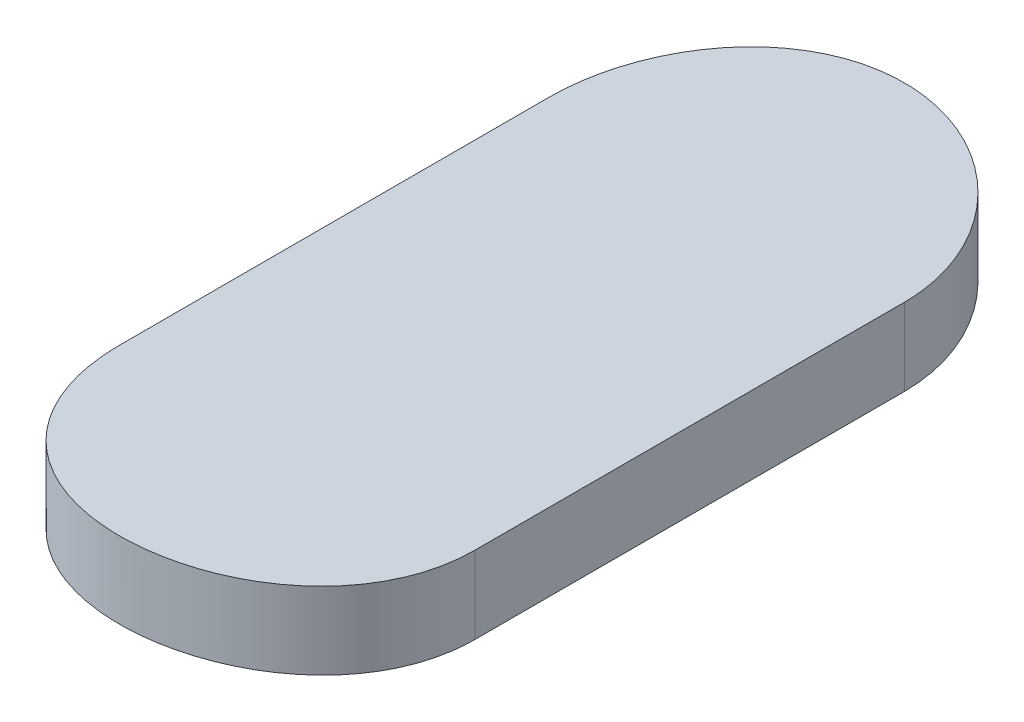
ISO-10303-21;
HEADER;
FILE_DESCRIPTION(('STEP AP214'),'2;1');
FILE_NAME('part.step','',(''),(''),'','','');
FILE_SCHEMA(('AUTOMOTIVE_DESIGN { 1 0 10303 214 1 1 1 1 }'));
ENDSEC;
DATA;
#1=APPLICATION_CONTEXT('core data for automotive mechanical design processes');
#2=APPLICATION_PROTOCOL_DEFINITION('international standard','automotive_design',2000,#1);
#3=PRODUCT_CONTEXT('',#1,'mechanical');
#4=PRODUCT('Part','Part','',(#3));
#5=PRODUCT_RELATED_PRODUCT_CATEGORY('part','',(#4));
#6=PRODUCT_DEFINITION_FORMATION('','',#4);
#7=PRODUCT_DEFINITION_CONTEXT('part definition',#1,'design');
#8=PRODUCT_DEFINITION('design','',#6,#7);
#9=PRODUCT_DEFINITION_SHAPE('','',#8);
#10=(LENGTH_UNIT() NAMED_UNIT(*) SI_UNIT(.MILLI.,.METRE.));
#11=(NAMED_UNIT(*) PLANE_ANGLE_UNIT() SI_UNIT($,.RADIAN.));
#12=(NAMED_UNIT(*) SI_UNIT($,.STERADIAN.) SOLID_ANGLE_UNIT());
#13=UNCERTAINTY_MEASURE_WITH_UNIT(LENGTH_MEASURE(1.E-05),#10,'distance_accuracy_value','');
#14=(GEOMETRIC_REPRESENTATION_CONTEXT(3) GLOBAL_UNCERTAINTY_ASSIGNED_CONTEXT((#13)) GLOBAL_UNIT_ASSIGNED_CONTEXT((#10,
#11,#12)) REPRESENTATION_CONTEXT('',''));
#15=CARTESIAN_POINT('',(0.,0.,0.));
#16=DIRECTION('',(0.,0.,1.));
#17=DIRECTION('',(1.,0.,0.));
#18=AXIS2_PLACEMENT_3D('',#15,#16,#17);
#19=CARTESIAN_POINT('',(-75.4181941684126,-39.6644186635389,0.584683614855501));
#20=DIRECTION('',(0.,0.,1.));
#21=DIRECTION('',(1.,0.,0.));
#22=AXIS2_PLACEMENT_3D('',#19,#20,#21);
#23=CYLINDRICAL_SURFACE('',#22,2.00000000000003);
#24=DIRECTION('',(0.,0.,1.));
#25=VECTOR('',#24,1.);
#26=CARTESIAN_POINT('',(-75.6966157953255,-37.6838931278117,-0.202724824976189));
#27=LINE('',#26,#25);
#28=CARTESIAN_POINT('',(-75.6966157953255,-37.6838931278117,-0.876239996943084));
#29=VERTEX_POINT('',#28);
#30=CARTESIAN_POINT('',(-75.6966157953255,-37.6838931278117,-0.202724824976189));
#31=VERTEX_POINT('',#30);
#32=EDGE_CURVE('E72',#29,#31,#27,.T.);
#33=ORIENTED_EDGE('',*,*,#32,.T.);
#34=CARTESIAN_POINT('',(-75.1397725414866,-37.6838931278136,-0.202724824976189));
#35=CARTESIAN_POINT('',(-75.1397588796207,-37.6839002866824,-0.187141875815704));
#36=CARTESIAN_POINT('',(-75.1410799225853,-37.6837094111274,-0.171564623124754));
#37=CARTESIAN_POINT('',(-75.1462885944889,-37.6829849067766,-0.140870770455341));
#38=CARTESIAN_POINT('',(-75.1501733182881,-37.6824516659645,-0.12575366929832));
#39=CARTESIAN_POINT('',(-75.1604085498956,-37.6810953115339,-0.0963875867482108));
#40=CARTESIAN_POINT('',(-75.1667598272963,-37.680272107451,-0.0821388779101507));
#41=CARTESIAN_POINT('',(-75.1817396397894,-37.6784311594776,-0.0549102128572712));
#42=CARTESIAN_POINT('',(-75.1903679668946,-37.6774134333571,-0.0419301409126299));
#43=CARTESIAN_POINT('',(-75.2097197306448,-37.6752898729645,-0.017519262394172));
#44=CARTESIAN_POINT('',(-75.2204553998979,-37.674183547727,-0.00609819521607324));
#45=CARTESIAN_POINT('',(-75.2436949315732,-37.6720115826156,0.014790159605101));
#46=CARTESIAN_POINT('',(-75.2561994511821,-37.6709459580511,0.0242567178534485));
#47=CARTESIAN_POINT('',(-75.2826865812824,-37.6689701638389,0.0410024530265353));
#48=CARTESIAN_POINT('',(-75.2966756305399,-37.6680607202235,0.0482715274874376));
#49=CARTESIAN_POINT('',(-75.3256802616351,-37.6665069471062,0.0603454748180267));
#50=CARTESIAN_POINT('',(-75.3406946165842,-37.6658623070035,0.0651532363210148));
#51=CARTESIAN_POINT('',(-75.3661906867543,-37.6650687404205,0.0709972326099796));
#52=CARTESIAN_POINT('',(-75.3765094630458,-37.6648261366692,0.0727570153843644));
#53=CARTESIAN_POINT('',(-75.3972820582866,-37.6645010155627,0.0751070323408682));
#54=CARTESIAN_POINT('',(-75.4077358788044,-37.6644185000685,0.0756972529266205));
#55=CARTESIAN_POINT('',(-75.4337519183809,-37.6644189067167,0.0756961310651435));
#56=CARTESIAN_POINT('',(-75.449319558229,-37.6646021145814,0.0743883315943075));
#57=CARTESIAN_POINT('',(-75.4800209223927,-37.6653153707964,0.0691923537684175));
#58=CARTESIAN_POINT('',(-75.4951541758995,-37.6658457816674,0.0653014783178203));
#59=CARTESIAN_POINT('',(-75.524537296991,-37.6671937576896,0.0550571732085152));
#60=CARTESIAN_POINT('',(-75.538787810993,-37.6680111097223,0.048705570833445));
#61=CARTESIAN_POINT('',(-75.5660183827944,-37.669842397042,0.0337241325302379));
#62=CARTESIAN_POINT('',(-75.5789986259308,-37.6708563035864,0.0250946296373017));
#63=CARTESIAN_POINT('',(-75.6034100675533,-37.6729753872155,0.00574041051216187));
#64=CARTESIAN_POINT('',(-75.6148314615177,-37.6740810774153,-0.00499661651701656));
#65=CARTESIAN_POINT('',(-75.6357169845139,-37.6762550992279,-0.0282356060162432));
#66=CARTESIAN_POINT('',(-75.6451809299362,-37.6773234273283,-0.0407377338684803));
#67=CARTESIAN_POINT('',(-75.6619217538811,-37.6793069555814,-0.0672183558415131));
#68=CARTESIAN_POINT('',(-75.6691886877188,-37.6802214513813,-0.0812031871383885));
#69=CARTESIAN_POINT('',(-75.6812636393248,-37.6817861316722,-0.110207626004518));
#70=CARTESIAN_POINT('',(-75.6860730762994,-37.6824364686703,-0.12522663063779));
#71=CARTESIAN_POINT('',(-75.691918595569,-37.6832370693846,-0.150733239253837));
#72=CARTESIAN_POINT('',(-75.6936785663991,-37.6834818214154,-0.161057792925534));
#73=CARTESIAN_POINT('',(-75.6960272293276,-37.6838103779396,-0.181828299548326));
#74=CARTESIAN_POINT('',(-75.6966174212662,-37.6838943885239,-0.192274079750691));
#75=CARTESIAN_POINT('',(-75.6966157953255,-37.6838931278118,-0.202724824976188));
#76=B_SPLINE_CURVE_WITH_KNOTS('',3,(#34,#35,#36,#37,#38,#39,#40,#41,#42,#43,#44,#45,#46,#47,#48,
#49,#50,#51,#52,#53,#54,#55,#56,#57,#58,#59,#60,#61,#62,#63,#64,#65,#66,#67,#68,#69,#70,#71,#72,
#73,#74,#75),.UNSPECIFIED.,.F.,.F.,(4,2,2,2,2,2,2,2,2,2,2,2,2,2,2,2,2,2,2,2,4),(0.,
0.0466833192223902,0.0933138279618856,0.139958897647033,0.186599708214386,0.233519721309609,
0.28045721275786,0.327607317912815,0.374701959415367,0.406050734595082,0.437399874207701,
0.484034849393329,0.530718594814422,0.577367740117711,0.62401006896399,0.670933427046094,
0.717861184561916,0.764998283538022,0.812108129951557,0.84347406083282,0.874799749581129),.UNSPECIFIED.);
#77=CARTESIAN_POINT('',(-75.1397725414866,-37.6838931278136,-0.202724824976189));
#78=VERTEX_POINT('',#77);
#79=EDGE_CURVE('E21',#78,#31,#76,.T.);
#80=ORIENTED_EDGE('',*,*,#79,.F.);
#81=DIRECTION('',(0.,0.,1.));
#82=VECTOR('',#81,1.);
#83=CARTESIAN_POINT('',(-75.1397725414866,-37.6838931278136,-0.876239996943084));
#84=LINE('',#83,#82);
#85=CARTESIAN_POINT('',(-75.1397725414866,-37.6838931278136,-0.876239996943084));
#86=VERTEX_POINT('',#85);
#87=EDGE_CURVE('E59',#78,#86,#84,.F.);
#88=ORIENTED_EDGE('',*,*,#87,.T.);
#89=CARTESIAN_POINT('',(-75.6966157953255,-37.6838931278118,-0.876239996943084));
#90=CARTESIAN_POINT('',(-75.6966294551295,-37.6839002867788,-0.891822988339054));
#91=CARTESIAN_POINT('',(-75.6953084060336,-37.6837094101403,-0.907400283165706));
#92=CARTESIAN_POINT('',(-75.6900997223513,-37.682984903865,-0.938094133465485));
#93=CARTESIAN_POINT('',(-75.6862150067653,-37.682451664063,-0.953211192509949));
#94=CARTESIAN_POINT('',(-75.6759798910917,-37.681095325679,-0.982576930125822));
#95=CARTESIAN_POINT('',(-75.6696287659323,-37.6802721418662,-0.996825351909937));
#96=CARTESIAN_POINT('',(-75.6546490646654,-37.6784312018188,-1.02405406674273));
#97=CARTESIAN_POINT('',(-75.6460206019817,-37.6774134552751,-1.03703442290386));
#98=CARTESIAN_POINT('',(-75.6266675065483,-37.6752897558642,-1.06144691177608));
#99=CARTESIAN_POINT('',(-75.6159304559895,-37.6741833046273,-1.07286915825552));
#100=CARTESIAN_POINT('',(-75.5926907558505,-37.6720113462003,-1.09375706113424));
#101=CARTESIAN_POINT('',(-75.580187837307,-37.6709458452788,-1.1032224189333));
#102=CARTESIAN_POINT('',(-75.553708465243,-37.6689706990596,-1.11996281564446));
#103=CARTESIAN_POINT('',(-75.5397261782164,-37.6680617109434,-1.12722871151884));
#104=CARTESIAN_POINT('',(-75.5107258272774,-37.6665076298967,-1.13930493239215));
#105=CARTESIAN_POINT('',(-75.4957078713967,-37.6658625094904,-1.14411551306882));
#106=CARTESIAN_POINT('',(-75.4651646944313,-37.6649123258311,-1.1511149726598));
#107=CARTESIAN_POINT('',(-75.4496433779763,-37.6646050922705,-1.15332059056576));
#108=CARTESIAN_POINT('',(-75.4184477239863,-37.6643578699444,-1.15509945766859));
#109=CARTESIAN_POINT('',(-75.4027733901594,-37.6644178723014,-1.15467277049825));
#110=CARTESIAN_POINT('',(-75.3718315278119,-37.6648966308364,-1.15121234613977));
#111=CARTESIAN_POINT('',(-75.3565619335515,-37.6653128992251,-1.14819668717069));
#112=CARTESIAN_POINT('',(-75.3267477544281,-37.6664546352049,-1.13967226496746));
#113=CARTESIAN_POINT('',(-75.3122031819229,-37.6671801080642,-1.13416345925504));
#114=CARTESIAN_POINT('',(-75.2841962757678,-37.6688630418128,-1.12079016574371));
#115=CARTESIAN_POINT('',(-75.2707376908188,-37.66982126401,-1.11291792694566));
#116=CARTESIAN_POINT('',(-75.2453263231457,-37.6718626513786,-1.09504723414018));
#117=CARTESIAN_POINT('',(-75.233373564732,-37.6729458185666,-1.08504874581319));
#118=CARTESIAN_POINT('',(-75.2112075527389,-37.6751268689559,-1.06310981584162));
#119=CARTESIAN_POINT('',(-75.2010096555949,-37.676224799518,-1.05115385765984));
#120=CARTESIAN_POINT('',(-75.1827599571932,-37.678302991191,-1.02568812536732));
#121=CARTESIAN_POINT('',(-75.1747087848961,-37.6792832177701,-1.01217789753306));
#122=CARTESIAN_POINT('',(-75.160978686353,-37.6810155063499,-0.98396796031451));
#123=CARTESIAN_POINT('',(-75.1553025839182,-37.6817672964648,-0.969266859691273));
#124=CARTESIAN_POINT('',(-75.1465149521259,-37.6829517101126,-0.939124873922756));
#125=CARTESIAN_POINT('',(-75.1433995707512,-37.6833848129343,-0.923685137049337));
#126=CARTESIAN_POINT('',(-75.1403810235822,-37.6838079660354,-0.897522279264225));
#127=CARTESIAN_POINT('',(-75.1397671156949,-37.6838956949834,-0.88687877129294));
#128=CARTESIAN_POINT('',(-75.1397725414866,-37.6838931278136,-0.876239996943085));
#129=B_SPLINE_CURVE_WITH_KNOTS('',3,(#89,#90,#91,#92,#93,#94,#95,#96,#97,#98,#99,#100,#101,#102,
#103,#104,#105,#106,#107,#108,#109,#110,#111,#112,#113,#114,#115,#116,#117,#118,#119,#120,#121,
#122,#123,#124,#125,#126,#127,#128),.UNSPECIFIED.,.F.,.F.,(4,2,2,2,2,2,2,2,2,2,2,2,2,2,2,2,2,2,
2,4),(0.,0.0466834452056831,0.0933138279590833,0.139957929441397,0.186599708232392,
0.233524883020567,0.280457212811403,0.327582040016525,0.374701959000846,0.421517417926937,
0.468331745150026,0.514821812645199,0.561312672268413,0.607957698215605,0.654603477111981,
0.701638704811785,0.748687698077969,0.795792471826851,0.842826256899454,0.874737605827837),.UNSPECIFIED.);
#130=EDGE_CURVE('E73',#29,#86,#129,.T.);
#131=ORIENTED_EDGE('',*,*,#130,.F.);
#132=EDGE_LOOP('',(#33,#80,#88,#131));
#133=FACE_BOUND('',#132,.T.);
#134=ADVANCED_FACE('F17',(#133),#23,.T.);
#135=CARTESIAN_POINT('',(-75.6966157953255,-36.7841716842097,-0.202724824976189));
#136=DIRECTION('',(1.,0.,0.));
#137=DIRECTION('',(0.,1.,0.));
#138=AXIS2_PLACEMENT_3D('',#135,#136,#137);
#139=PLANE('',#138);
#140=DIRECTION('',(0.,0.,1.));
#141=VECTOR('',#140,1.);
#142=CARTESIAN_POINT('',(-75.6966157953255,-37.8051496142436,0.584683614855501));
#143=LINE('',#142,#141);
#144=CARTESIAN_POINT('',(-75.6966157953255,-37.8051496142436,-0.876239996943084));
#145=VERTEX_POINT('',#144);
#146=CARTESIAN_POINT('',(-75.6966157953255,-37.8051496142436,-0.202724824976189));
#147=VERTEX_POINT('',#146);
#148=EDGE_CURVE('E80',#145,#147,#143,.T.);
#149=ORIENTED_EDGE('',*,*,#148,.T.);
#150=DIRECTION('',(0.,1.,0.));
#151=VECTOR('',#150,1.);
#152=CARTESIAN_POINT('',(-75.6966157953255,-36.7841716842097,-0.202724824976189));
#153=LINE('',#152,#151);
#154=EDGE_CURVE('E67',#31,#147,#153,.F.);
#155=ORIENTED_EDGE('',*,*,#154,.F.);
#156=ORIENTED_EDGE('',*,*,#32,.F.);
#157=DIRECTION('',(0.,1.,0.));
#158=VECTOR('',#157,1.);
#159=CARTESIAN_POINT('',(-75.6966157953255,-36.7841716842097,-0.876239996943084));
#160=LINE('',#159,#158);
#161=EDGE_CURVE('E106',#145,#29,#160,.T.);
#162=ORIENTED_EDGE('',*,*,#161,.F.);
#163=EDGE_LOOP('',(#149,#155,#156,#162));
#164=FACE_BOUND('',#163,.T.);
#165=ADVANCED_FACE('F79',(#164),#139,.F.);
#166=CARTESIAN_POINT('',(-75.418194168406,-36.7841716842097,-0.202724824976189));
#167=DIRECTION('',(0.,1.,0.));
#168=DIRECTION('',(0.,0.,1.));
#169=AXIS2_PLACEMENT_3D('',#166,#167,#168);
#170=CYLINDRICAL_SURFACE('',#169,0.278421626919453);
#171=DIRECTION('',(0.,-1.,0.));
#172=VECTOR('',#171,1.);
#173=CARTESIAN_POINT('',(-75.1397725414866,-36.7841716842097,-0.202724824976189));
#174=LINE('',#173,#172);
#175=CARTESIAN_POINT('',(-75.1397725414866,-37.8051496142456,-0.202724824976189));
#176=VERTEX_POINT('',#175);
#177=EDGE_CURVE('E69',#176,#78,#174,.F.);
#178=ORIENTED_EDGE('',*,*,#177,.T.);
#179=ORIENTED_EDGE('',*,*,#79,.T.);
#180=ORIENTED_EDGE('',*,*,#154,.T.);
#181=CARTESIAN_POINT('',(-75.6966157953255,-37.8051496142436,-0.202724824976189));
#182=CARTESIAN_POINT('',(-75.6966295038028,-37.8051572393913,-0.187152462553331));
#183=CARTESIAN_POINT('',(-75.6953101994287,-37.8049541814077,-0.171586025955926));
#184=CARTESIAN_POINT('',(-75.690109018842,-37.8041835505037,-0.140914681941049));
#185=CARTESIAN_POINT('',(-75.6862301803886,-37.8036164097132,-0.12580924959289));
#186=CARTESIAN_POINT('',(-75.6760114596759,-37.8021740062335,-0.0964664034057428));
#187=CARTESIAN_POINT('',(-75.6696708650069,-37.8012986543577,-0.0822292422176988));
#188=CARTESIAN_POINT('',(-75.6547171315147,-37.7993412078685,-0.0550213370955941));
#189=CARTESIAN_POINT('',(-75.6461041558783,-37.7982591281025,-0.0420505023142155));
#190=CARTESIAN_POINT('',(-75.6267793473538,-37.7960003153402,-0.0176443346418183));
#191=CARTESIAN_POINT('',(-75.616053666076,-37.794822989769,-0.00622002084505028));
#192=CARTESIAN_POINT('',(-75.592833632192,-37.7925113607528,0.0146772844179075));
#193=CARTESIAN_POINT('',(-75.5803386241755,-37.7913770734488,0.0241495495811071));
#194=CARTESIAN_POINT('',(-75.5538611205533,-37.7892729092734,0.0409141177970086));
#195=CARTESIAN_POINT('',(-75.5398713807072,-37.7883038982052,0.0481950850389702));
#196=CARTESIAN_POINT('',(-75.5108612947826,-37.7866479076237,0.0602919486642937));
#197=CARTESIAN_POINT('',(-75.495842182068,-37.7859605972493,0.0651107385588599));
#198=CARTESIAN_POINT('',(-75.4703176254345,-37.7851134497988,0.0709753253972236));
#199=CARTESIAN_POINT('',(-75.4599756186793,-37.7848541661652,0.0727432842077311));
#200=CARTESIAN_POINT('',(-75.4391552875877,-37.784506685393,0.0751042548116537));
#201=CARTESIAN_POINT('',(-75.4286769618496,-37.7844184900149,0.0756972545154312));
#202=CARTESIAN_POINT('',(-75.4026472370212,-37.7844189208899,0.0756961307426416));
#203=CARTESIAN_POINT('',(-75.3870904786617,-37.7846135507164,0.074390127178023));
#204=CARTESIAN_POINT('',(-75.3564110722337,-37.7853712857245,0.0692016194258765));
#205=CARTESIAN_POINT('',(-75.3412888926158,-37.7859347740282,0.0653164362638558));
#206=CARTESIAN_POINT('',(-75.311928068605,-37.7873668725892,0.0550881300648082));
#207=CARTESIAN_POINT('',(-75.2976887443478,-37.7882352445416,0.0487469263190536));
#208=CARTESIAN_POINT('',(-75.2704784810671,-37.7901811147863,0.0337909694055008));
#209=CARTESIAN_POINT('',(-75.2575073669559,-37.7912585841494,0.0251765306873663));
#210=CARTESIAN_POINT('',(-75.2331009309381,-37.7935119466699,0.00584900201802109));
#211=CARTESIAN_POINT('',(-75.2216766416652,-37.7946884587713,-0.00487794823415628));
#212=CARTESIAN_POINT('',(-75.2007828077585,-37.7970025136342,-0.028097158253855));
#213=CARTESIAN_POINT('',(-75.1913134520173,-37.7981400526213,-0.0405895884120808));
#214=CARTESIAN_POINT('',(-75.1745540920291,-37.8002535759086,-0.0670604647535609));
#215=CARTESIAN_POINT('',(-75.1672753254846,-37.8012287160713,-0.0810460910419085));
#216=CARTESIAN_POINT('',(-75.1551776282177,-37.8028978267722,-0.110056103330259));
#217=CARTESIAN_POINT('',(-75.1503572558827,-37.8035919620434,-0.125079874674508));
#218=CARTESIAN_POINT('',(-75.144491415594,-37.8044475770177,-0.150614570821207));
#219=CARTESIAN_POINT('',(-75.1427233918427,-37.8047094639075,-0.160961923684664));
#220=CARTESIAN_POINT('',(-75.1403638552584,-37.8050610563511,-0.181779567505606));
#221=CARTESIAN_POINT('',(-75.1397708703736,-37.8051509773333,-0.192249688092487));
#222=CARTESIAN_POINT('',(-75.1397725414866,-37.8051496142456,-0.202724824976186));
#223=B_SPLINE_CURVE_WITH_KNOTS('',3,(#181,#182,#183,#184,#185,#186,#187,#188,#189,#190,#191,
#192,#193,#194,#195,#196,#197,#198,#199,#200,#201,#202,#203,#204,#205,#206,#207,#208,#209,#210,
#211,#212,#213,#214,#215,#216,#217,#218,#219,#220,#221,#222),.UNSPECIFIED.,.F.,.F.,(4,2,2,2,2,2,
2,2,2,2,2,2,2,2,2,2,2,2,2,2,4),(0.,0.0466511443936092,0.0932470206513881,0.139856391389543,
0.186462415871439,0.233384759868322,0.280324530968138,0.32750310992928,0.374626117122651,
0.406048286567917,0.43747077932713,0.484073179873423,0.530724061879886,0.577338561226521,
0.623946615908499,0.670871318505151,0.717800553014244,0.76496658388046,0.812104924496496,
0.843542947120781,0.874941560220144),.UNSPECIFIED.);
#224=EDGE_CURVE('E91',#147,#176,#223,.T.);
#225=ORIENTED_EDGE('',*,*,#224,.T.);
#226=EDGE_LOOP('',(#178,#179,#180,#225));
#227=FACE_BOUND('',#226,.T.);
#228=ADVANCED_FACE('F65',(#227),#170,.T.);
#229=CARTESIAN_POINT('',(-75.1397725414866,-36.7841716842097,-0.876239996943084));
#230=DIRECTION('',(-1.,0.,0.));
#231=DIRECTION('',(0.,-1.,0.));
#232=AXIS2_PLACEMENT_3D('',#229,#230,#231);
#233=PLANE('',#232);
#234=DIRECTION('',(0.,0.,1.));
#235=VECTOR('',#234,1.);
#236=CARTESIAN_POINT('',(-75.1397725414866,-37.8051496142456,0.584683614855501));
#237=LINE('',#236,#235);
#238=CARTESIAN_POINT('',(-75.1397725414866,-37.8051496142456,-0.876239996943084));
#239=VERTEX_POINT('',#238);
#240=EDGE_CURVE('E31',#176,#239,#237,.F.);
#241=ORIENTED_EDGE('',*,*,#240,.T.);
#242=DIRECTION('',(0.,1.,0.));
#243=VECTOR('',#242,1.);
#244=CARTESIAN_POINT('',(-75.1397725414866,-36.7841716842097,-0.876239996943084));
#245=LINE('',#244,#243);
#246=EDGE_CURVE('E39',#86,#239,#245,.F.);
#247=ORIENTED_EDGE('',*,*,#246,.F.);
#248=ORIENTED_EDGE('',*,*,#87,.F.);
#249=ORIENTED_EDGE('',*,*,#177,.F.);
#250=EDGE_LOOP('',(#241,#247,#248,#249));
#251=FACE_BOUND('',#250,.T.);
#252=ADVANCED_FACE('F101',(#251),#233,.F.);
#253=CARTESIAN_POINT('',(-75.418194168406,-36.7841716842097,-0.876239996943084));
#254=DIRECTION('',(0.,1.,0.));
#255=DIRECTION('',(0.,0.,1.));
#256=AXIS2_PLACEMENT_3D('',#253,#254,#255);
#257=CYLINDRICAL_SURFACE('',#256,0.278421626919453);
#258=ORIENTED_EDGE('',*,*,#246,.T.);
#259=CARTESIAN_POINT('',(-75.1397725414866,-37.8051496142456,-0.876239996943084));
#260=CARTESIAN_POINT('',(-75.1397588350659,-37.8051572394955,-0.891812399706123));
#261=CARTESIAN_POINT('',(-75.1410781452483,-37.804954180409,-0.907378876550649));
#262=CARTESIAN_POINT('',(-75.1462793369872,-37.8041835475463,-0.938050218302628));
#263=CARTESIAN_POINT('',(-75.1501581675563,-37.8036164077817,-0.953155610428203));
#264=CARTESIAN_POINT('',(-75.1603767740938,-37.8021740211422,-0.982498116493978));
#265=CARTESIAN_POINT('',(-75.166717218209,-37.8012986906222,-0.99673499348126));
#266=CARTESIAN_POINT('',(-75.1816708416012,-37.7993412524808,-1.02394294783035));
#267=CARTESIAN_POINT('',(-75.1902839511942,-37.7982591511998,-1.03691406398594));
#268=CARTESIAN_POINT('',(-75.209610081683,-37.7960001914588,-1.06132183193064));
#269=CARTESIAN_POINT('',(-75.220337135329,-37.7948227325701,-1.07274731862717));
#270=CARTESIAN_POINT('',(-75.24355733616,-37.7925111105833,-1.09364417503574));
#271=CARTESIAN_POINT('',(-75.2560507526851,-37.7913769541217,-1.10311524619012));
#272=CARTESIAN_POINT('',(-75.2825205313667,-37.7892734773686,-1.11987448991474));
#273=CARTESIAN_POINT('',(-75.2965035333387,-37.7883049499183,-1.12715228352553));
#274=CARTESIAN_POINT('',(-75.3255093448904,-37.7866486332373,-1.139251412978));
#275=CARTESIAN_POINT('',(-75.3405320404209,-37.7859608132713,-1.14407301776805));
#276=CARTESIAN_POINT('',(-75.3710751559233,-37.7849476053348,-1.15108928606224));
#277=CARTESIAN_POINT('',(-75.3865911407171,-37.7846196076603,-1.15330287368032));
#278=CARTESIAN_POINT('',(-75.4177779262481,-37.7843540561494,-1.15509903532142));
#279=CARTESIAN_POINT('',(-75.4334487222802,-37.7844164904834,-1.15468168905808));
#280=CARTESIAN_POINT('',(-75.4643703881213,-37.7849226954765,-1.15124268682392));
#281=CARTESIAN_POINT('',(-75.4796235860829,-37.7853634744948,-1.1482414614991));
#282=CARTESIAN_POINT('',(-75.509407354373,-37.7865735031477,-1.13975197283414));
#283=CARTESIAN_POINT('',(-75.5239379107623,-37.7873427591156,-1.13426366154066));
#284=CARTESIAN_POINT('',(-75.5519262334113,-37.7891284688191,-1.12093469329849));
#285=CARTESIAN_POINT('',(-75.5653798133417,-37.7901458303543,-1.11308537239797));
#286=CARTESIAN_POINT('',(-75.5907860118106,-37.7923142655683,-1.09526386512923));
#287=CARTESIAN_POINT('',(-75.6027385934253,-37.793465342535,-1.08529162655445));
#288=CARTESIAN_POINT('',(-75.6249230883978,-37.7957857527397,-1.06339487952421));
#289=CARTESIAN_POINT('',(-75.6351376474299,-37.7969551556573,-1.0514527885519));
#290=CARTESIAN_POINT('',(-75.6534231928164,-37.7991700170521,-1.02601095334979));
#291=CARTESIAN_POINT('',(-75.6614935565659,-37.8002154394806,-1.01251075832553));
#292=CARTESIAN_POINT('',(-75.6752647807048,-37.8020645134775,-0.984313813554719));
#293=CARTESIAN_POINT('',(-75.6809624931049,-37.8028678434544,-0.969615504876419));
#294=CARTESIAN_POINT('',(-75.6897927764177,-37.8041349922365,-0.939473533656223));
#295=CARTESIAN_POINT('',(-75.6929291941156,-37.8045993200743,-0.924031025901366));
#296=CARTESIAN_POINT('',(-75.6959941379899,-37.805056928479,-0.897751166993737));
#297=CARTESIAN_POINT('',(-75.6966214061108,-37.8051524387913,-0.88699326360593));
#298=CARTESIAN_POINT('',(-75.6966157953255,-37.8051496142436,-0.876239996943084));
#299=B_SPLINE_CURVE_WITH_KNOTS('',3,(#259,#260,#261,#262,#263,#264,#265,#266,#267,#268,#269,
#270,#271,#272,#273,#274,#275,#276,#277,#278,#279,#280,#281,#282,#283,#284,#285,#286,#287,#288,
#289,#290,#291,#292,#293,#294,#295,#296,#297,#298),.UNSPECIFIED.,.F.,.F.,(4,2,2,2,2,2,2,2,2,2,2,
2,2,2,2,2,2,2,2,4),(0.,0.046651264728333,0.0932470206483179,0.139855432735308,0.186462415891345,
0.233389891773645,0.28032453102654,0.327477905993089,0.374626116637625,0.42143006445936,
0.46823259419323,0.514668421450695,0.561105144072014,0.607714393845471,0.654324789960879,
0.701376291565872,0.748441440513791,0.795568837177584,0.842625322780671,0.874879345791479),.UNSPECIFIED.);
#300=EDGE_CURVE('E11',#239,#145,#299,.T.);
#301=ORIENTED_EDGE('',*,*,#300,.T.);
#302=ORIENTED_EDGE('',*,*,#161,.T.);
#303=ORIENTED_EDGE('',*,*,#130,.T.);
#304=EDGE_LOOP('',(#258,#301,#302,#303));
#305=FACE_BOUND('',#304,.T.);
#306=ADVANCED_FACE('F97',(#305),#257,.T.);
#307=CARTESIAN_POINT('',(-75.4181941684126,-39.6644186635389,0.584683614855501));
#308=DIRECTION('',(0.,0.,1.));
#309=DIRECTION('',(1.,0.,0.));
#310=AXIS2_PLACEMENT_3D('',#307,#308,#309);
#311=CYLINDRICAL_SURFACE('',#310,1.88000000000003);
#312=ORIENTED_EDGE('',*,*,#240,.F.);
#313=ORIENTED_EDGE('',*,*,#224,.F.);
#314=ORIENTED_EDGE('',*,*,#148,.F.);
#315=ORIENTED_EDGE('',*,*,#300,.F.);
#316=EDGE_LOOP('',(#312,#313,#314,#315));
#317=FACE_BOUND('',#316,.T.);
#318=ADVANCED_FACE('F95',(#317),#311,.F.);
#319=CLOSED_SHELL('',(#134,#165,#228,#252,#306,#318));
#320=MANIFOLD_SOLID_BREP('B1',#319);
#321=ADVANCED_BREP_SHAPE_REPRESENTATION('',(#18,#320),#14);
#322=SHAPE_DEFINITION_REPRESENTATION(#9,#321);
ENDSEC;
END-ISO-10303-21;
